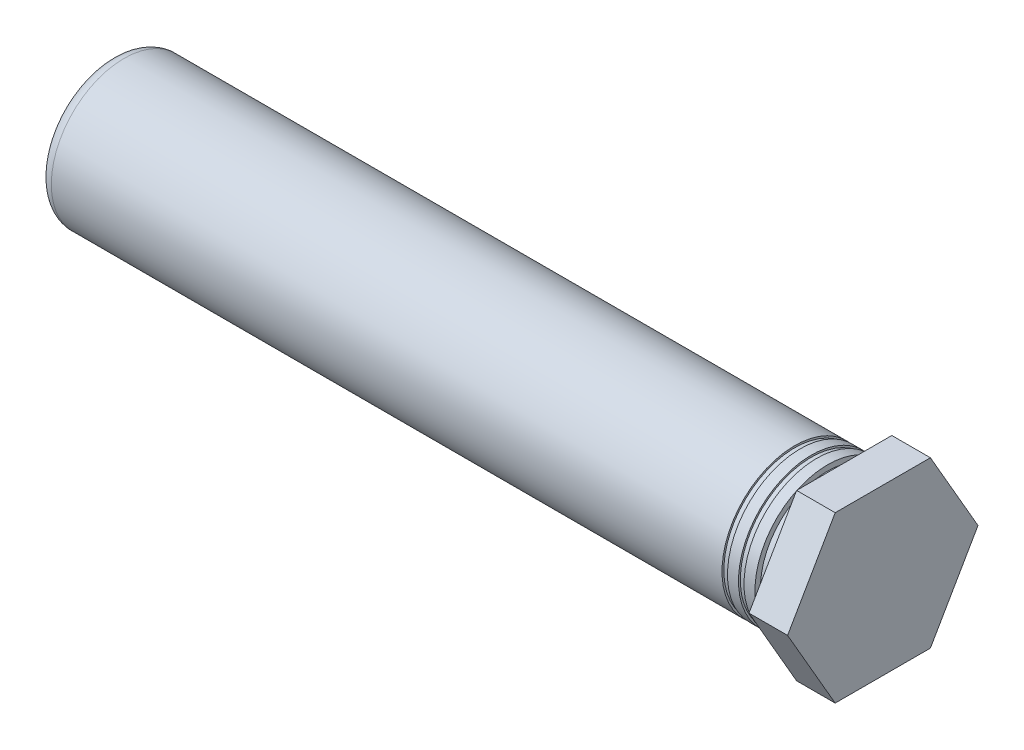
ISO-10303-21;
HEADER;
FILE_DESCRIPTION(('STEP AP214'),'2;1');
FILE_NAME('part.step','',(''),(''),'','','');
FILE_SCHEMA(('AUTOMOTIVE_DESIGN { 1 0 10303 214 1 1 1 1 }'));
ENDSEC;
DATA;
#1=APPLICATION_CONTEXT('core data for automotive mechanical design processes');
#2=APPLICATION_PROTOCOL_DEFINITION('international standard','automotive_design',2000,#1);
#3=PRODUCT_CONTEXT('',#1,'mechanical');
#4=PRODUCT('Part','Part','',(#3));
#5=PRODUCT_RELATED_PRODUCT_CATEGORY('part','',(#4));
#6=PRODUCT_DEFINITION_FORMATION('','',#4);
#7=PRODUCT_DEFINITION_CONTEXT('part definition',#1,'design');
#8=PRODUCT_DEFINITION('design','',#6,#7);
#9=PRODUCT_DEFINITION_SHAPE('','',#8);
#10=(LENGTH_UNIT() NAMED_UNIT(*) SI_UNIT(.MILLI.,.METRE.));
#11=(NAMED_UNIT(*) PLANE_ANGLE_UNIT() SI_UNIT($,.RADIAN.));
#12=(NAMED_UNIT(*) SI_UNIT($,.STERADIAN.) SOLID_ANGLE_UNIT());
#13=UNCERTAINTY_MEASURE_WITH_UNIT(LENGTH_MEASURE(1.E-05),#10,'distance_accuracy_value','');
#14=(GEOMETRIC_REPRESENTATION_CONTEXT(3) GLOBAL_UNCERTAINTY_ASSIGNED_CONTEXT((#13)) GLOBAL_UNIT_ASSIGNED_CONTEXT((#10,
#11,#12)) REPRESENTATION_CONTEXT('',''));
#15=CARTESIAN_POINT('',(0.,0.,0.));
#16=DIRECTION('',(0.,0.,1.));
#17=DIRECTION('',(1.,0.,0.));
#18=AXIS2_PLACEMENT_3D('',#15,#16,#17);
#19=CARTESIAN_POINT('',(1.11125,-2.3749,-2.7422983085969));
#20=DIRECTION('',(1.,0.,0.));
#21=DIRECTION('',(0.,1.,0.));
#22=AXIS2_PLACEMENT_3D('',#19,#20,#21);
#23=PLANE('',#22);
#24=DIRECTION('',(0.,0.,1.));
#25=VECTOR('',#24,1.);
#26=CARTESIAN_POINT('',(1.11125,-2.3749,0.));
#27=LINE('',#26,#25);
#28=CARTESIAN_POINT('',(1.11125,-2.3749,-1.3711491542984));
#29=VERTEX_POINT('',#28);
#30=CARTESIAN_POINT('',(1.11125,-2.3749,1.3711491542984));
#31=VERTEX_POINT('',#30);
#32=EDGE_CURVE('E77',#29,#31,#27,.T.);
#33=ORIENTED_EDGE('',*,*,#32,.F.);
#34=DIRECTION('',(0.,-0.86602540378443,0.500000000000015));
#35=VECTOR('',#34,1.);
#36=CARTESIAN_POINT('',(1.11125,-1.18745,-2.05672373144765));
#37=LINE('',#36,#35);
#38=CARTESIAN_POINT('',(1.11125,2.50003124105391E-10,-2.74229830845256));
#39=VERTEX_POINT('',#38);
#40=EDGE_CURVE('E73',#39,#29,#37,.T.);
#41=ORIENTED_EDGE('',*,*,#40,.F.);
#42=DIRECTION('',(0.,-0.866025403784429,-0.500000000000016));
#43=VECTOR('',#42,1.);
#44=CARTESIAN_POINT('',(1.11125,1.18745,-2.05672373144765));
#45=LINE('',#44,#43);
#46=CARTESIAN_POINT('',(1.11125,2.3749,-1.3711491542984));
#47=VERTEX_POINT('',#46);
#48=EDGE_CURVE('E75',#47,#39,#45,.T.);
#49=ORIENTED_EDGE('',*,*,#48,.F.);
#50=DIRECTION('',(0.,0.,-1.));
#51=VECTOR('',#50,1.);
#52=CARTESIAN_POINT('',(1.11125,2.3749,0.));
#53=LINE('',#52,#51);
#54=CARTESIAN_POINT('',(1.11125,2.3749,1.3711491542984));
#55=VERTEX_POINT('',#54);
#56=EDGE_CURVE('E59',#55,#47,#53,.T.);
#57=ORIENTED_EDGE('',*,*,#56,.F.);
#58=DIRECTION('',(0.,0.866025403784429,-0.500000000000016));
#59=VECTOR('',#58,1.);
#60=CARTESIAN_POINT('',(1.11125,1.18745,2.05672373144765));
#61=LINE('',#60,#59);
#62=CARTESIAN_POINT('',(1.11125,2.49999673740398E-10,2.74229830845256));
#63=VERTEX_POINT('',#62);
#64=EDGE_CURVE('E119',#63,#55,#61,.T.);
#65=ORIENTED_EDGE('',*,*,#64,.F.);
#66=DIRECTION('',(0.,0.866025403784429,0.500000000000016));
#67=VECTOR('',#66,1.);
#68=CARTESIAN_POINT('',(1.11125,-1.18745,2.05672373144765));
#69=LINE('',#68,#67);
#70=EDGE_CURVE('E106',#31,#63,#69,.T.);
#71=ORIENTED_EDGE('',*,*,#70,.F.);
#72=EDGE_LOOP('',(#33,#41,#49,#57,#65,#71));
#73=FACE_BOUND('',#72,.T.);
#74=ADVANCED_FACE('F16',(#73),#23,.T.);
#75=CARTESIAN_POINT('',(1.11125,0.,-2.7422983085969));
#76=DIRECTION('',(0.,0.500000000000016,-0.866025403784429));
#77=DIRECTION('',(-1.,0.,0.));
#78=AXIS2_PLACEMENT_3D('',#75,#76,#77);
#79=PLANE('',#78);
#80=CARTESIAN_POINT('',(1.11125,0.,-2.7422983085969));
#81=CARTESIAN_POINT('',(0.,0.,-2.7422983085969));
#82=B_SPLINE_CURVE_WITH_KNOTS('',1,(#80,#81),.UNSPECIFIED.,.F.,.F.,(2,2),(0.,1.11125),.UNSPECIFIED.);
#83=CARTESIAN_POINT('',(0.,0.,-2.7422983085969));
#84=VERTEX_POINT('',#83);
#85=EDGE_CURVE('E81',#84,#39,#82,.F.);
#86=ORIENTED_EDGE('',*,*,#85,.F.);
#87=DIRECTION('',(0.,-0.866025403784429,-0.500000000000016));
#88=VECTOR('',#87,1.);
#89=CARTESIAN_POINT('',(0.,2.3749,-1.3711491542984));
#90=LINE('',#89,#88);
#91=CARTESIAN_POINT('',(0.,2.3749,-1.3711491542984));
#92=VERTEX_POINT('',#91);
#93=EDGE_CURVE('E20',#92,#84,#90,.T.);
#94=ORIENTED_EDGE('',*,*,#93,.F.);
#95=CARTESIAN_POINT('',(1.11125,2.3749,-1.3711491542984));
#96=CARTESIAN_POINT('',(0.,2.3749,-1.3711491542984));
#97=B_SPLINE_CURVE_WITH_KNOTS('',1,(#95,#96),.UNSPECIFIED.,.F.,.F.,(2,2),(0.,1.11125),.UNSPECIFIED.);
#98=EDGE_CURVE('E85',#47,#92,#97,.T.);
#99=ORIENTED_EDGE('',*,*,#98,.F.);
#100=ORIENTED_EDGE('',*,*,#48,.T.);
#101=EDGE_LOOP('',(#86,#94,#99,#100));
#102=FACE_BOUND('',#101,.T.);
#103=ADVANCED_FACE('F83',(#102),#79,.T.);
#104=CARTESIAN_POINT('',(1.11125,-2.3749,-1.3711491542984));
#105=DIRECTION('',(0.,-0.500000000000015,-0.86602540378443));
#106=DIRECTION('',(-1.,0.,0.));
#107=AXIS2_PLACEMENT_3D('',#104,#105,#106);
#108=PLANE('',#107);
#109=CARTESIAN_POINT('',(1.11125,-2.3749,-1.3711491542984));
#110=CARTESIAN_POINT('',(0.,-2.3749,-1.3711491542984));
#111=B_SPLINE_CURVE_WITH_KNOTS('',1,(#109,#110),.UNSPECIFIED.,.F.,.F.,(2,2),(0.,1.11125),.UNSPECIFIED.);
#112=CARTESIAN_POINT('',(0.,-2.3749,-1.3711491542984));
#113=VERTEX_POINT('',#112);
#114=EDGE_CURVE('E91',#113,#29,#111,.F.);
#115=ORIENTED_EDGE('',*,*,#114,.F.);
#116=DIRECTION('',(0.,-0.86602540378443,0.500000000000015));
#117=VECTOR('',#116,1.);
#118=CARTESIAN_POINT('',(0.,0.,-2.7422983085969));
#119=LINE('',#118,#117);
#120=EDGE_CURVE('E89',#84,#113,#119,.T.);
#121=ORIENTED_EDGE('',*,*,#120,.F.);
#122=ORIENTED_EDGE('',*,*,#85,.T.);
#123=ORIENTED_EDGE('',*,*,#40,.T.);
#124=EDGE_LOOP('',(#115,#121,#122,#123));
#125=FACE_BOUND('',#124,.T.);
#126=ADVANCED_FACE('F87',(#125),#108,.T.);
#127=CARTESIAN_POINT('',(1.11125,-2.3749,1.3711491542984));
#128=DIRECTION('',(0.,-1.,0.));
#129=DIRECTION('',(-1.,0.,0.));
#130=AXIS2_PLACEMENT_3D('',#127,#128,#129);
#131=PLANE('',#130);
#132=CARTESIAN_POINT('',(1.11125,-2.3749,1.3711491542984));
#133=CARTESIAN_POINT('',(0.,-2.3749,1.3711491542984));
#134=B_SPLINE_CURVE_WITH_KNOTS('',1,(#132,#133),.UNSPECIFIED.,.F.,.F.,(2,2),(0.,1.11125),.UNSPECIFIED.);
#135=CARTESIAN_POINT('',(0.,-2.3749,1.3711491542984));
#136=VERTEX_POINT('',#135);
#137=EDGE_CURVE('E114',#136,#31,#134,.F.);
#138=ORIENTED_EDGE('',*,*,#137,.F.);
#139=DIRECTION('',(0.,0.,1.));
#140=VECTOR('',#139,1.);
#141=CARTESIAN_POINT('',(0.,-2.3749,0.));
#142=LINE('',#141,#140);
#143=EDGE_CURVE('E107',#113,#136,#142,.T.);
#144=ORIENTED_EDGE('',*,*,#143,.F.);
#145=ORIENTED_EDGE('',*,*,#114,.T.);
#146=ORIENTED_EDGE('',*,*,#32,.T.);
#147=EDGE_LOOP('',(#138,#144,#145,#146));
#148=FACE_BOUND('',#147,.T.);
#149=ADVANCED_FACE('F384',(#148),#131,.T.);
#150=CARTESIAN_POINT('',(1.11125,0.,2.7422983085969));
#151=DIRECTION('',(0.,-0.500000000000016,0.866025403784429));
#152=DIRECTION('',(-1.,0.,0.));
#153=AXIS2_PLACEMENT_3D('',#150,#151,#152);
#154=PLANE('',#153);
#155=CARTESIAN_POINT('',(1.11125,0.,2.7422983085969));
#156=CARTESIAN_POINT('',(0.,0.,2.7422983085969));
#157=B_SPLINE_CURVE_WITH_KNOTS('',1,(#155,#156),.UNSPECIFIED.,.F.,.F.,(2,2),(0.,1.11125),.UNSPECIFIED.);
#158=CARTESIAN_POINT('',(0.,0.,2.7422983085969));
#159=VERTEX_POINT('',#158);
#160=EDGE_CURVE('E125',#159,#63,#157,.F.);
#161=ORIENTED_EDGE('',*,*,#160,.F.);
#162=DIRECTION('',(0.,0.866025403784429,0.500000000000016));
#163=VECTOR('',#162,1.);
#164=CARTESIAN_POINT('',(0.,-2.3749,1.3711491542984));
#165=LINE('',#164,#163);
#166=EDGE_CURVE('E113',#136,#159,#165,.T.);
#167=ORIENTED_EDGE('',*,*,#166,.F.);
#168=ORIENTED_EDGE('',*,*,#137,.T.);
#169=ORIENTED_EDGE('',*,*,#70,.T.);
#170=EDGE_LOOP('',(#161,#167,#168,#169));
#171=FACE_BOUND('',#170,.T.);
#172=ADVANCED_FACE('F207',(#171),#154,.T.);
#173=CARTESIAN_POINT('',(1.11125,2.3749,1.3711491542984));
#174=DIRECTION('',(0.,0.500000000000016,0.866025403784429));
#175=DIRECTION('',(-1.,0.,0.));
#176=AXIS2_PLACEMENT_3D('',#173,#174,#175);
#177=PLANE('',#176);
#178=CARTESIAN_POINT('',(1.11125,2.3749,1.3711491542984));
#179=CARTESIAN_POINT('',(0.,2.3749,1.3711491542984));
#180=B_SPLINE_CURVE_WITH_KNOTS('',1,(#178,#179),.UNSPECIFIED.,.F.,.F.,(2,2),(0.,1.11125),.UNSPECIFIED.);
#181=CARTESIAN_POINT('',(0.,2.3749,1.3711491542984));
#182=VERTEX_POINT('',#181);
#183=EDGE_CURVE('E124',#182,#55,#180,.F.);
#184=ORIENTED_EDGE('',*,*,#183,.F.);
#185=DIRECTION('',(0.,0.866025403784429,-0.500000000000016));
#186=VECTOR('',#185,1.);
#187=CARTESIAN_POINT('',(0.,0.,2.7422983085969));
#188=LINE('',#187,#186);
#189=EDGE_CURVE('E174',#159,#182,#188,.T.);
#190=ORIENTED_EDGE('',*,*,#189,.F.);
#191=ORIENTED_EDGE('',*,*,#160,.T.);
#192=ORIENTED_EDGE('',*,*,#64,.T.);
#193=EDGE_LOOP('',(#184,#190,#191,#192));
#194=FACE_BOUND('',#193,.T.);
#195=ADVANCED_FACE('F198',(#194),#177,.T.);
#196=CARTESIAN_POINT('',(1.11125,2.3749,-1.3711491542984));
#197=DIRECTION('',(0.,1.,0.));
#198=DIRECTION('',(-1.,0.,0.));
#199=AXIS2_PLACEMENT_3D('',#196,#197,#198);
#200=PLANE('',#199);
#201=ORIENTED_EDGE('',*,*,#98,.T.);
#202=DIRECTION('',(0.,0.,-1.));
#203=VECTOR('',#202,1.);
#204=CARTESIAN_POINT('',(0.,2.3749,0.));
#205=LINE('',#204,#203);
#206=EDGE_CURVE('E173',#182,#92,#205,.T.);
#207=ORIENTED_EDGE('',*,*,#206,.F.);
#208=ORIENTED_EDGE('',*,*,#183,.T.);
#209=ORIENTED_EDGE('',*,*,#56,.T.);
#210=EDGE_LOOP('',(#201,#207,#208,#209));
#211=FACE_BOUND('',#210,.T.);
#212=ADVANCED_FACE('F196',(#211),#200,.T.);
#213=CARTESIAN_POINT('',(0.,2.3749,-2.7422983085969));
#214=DIRECTION('',(-1.,0.,0.));
#215=DIRECTION('',(0.,-1.,0.));
#216=AXIS2_PLACEMENT_3D('',#213,#214,#215);
#217=PLANE('',#216);
#218=ORIENTED_EDGE('',*,*,#189,.T.);
#219=ORIENTED_EDGE('',*,*,#206,.T.);
#220=ORIENTED_EDGE('',*,*,#93,.T.);
#221=ORIENTED_EDGE('',*,*,#120,.T.);
#222=ORIENTED_EDGE('',*,*,#143,.T.);
#223=ORIENTED_EDGE('',*,*,#166,.T.);
#224=EDGE_LOOP('',(#218,#219,#220,#221,#222,#223));
#225=FACE_BOUND('',#224,.T.);
#226=CARTESIAN_POINT('',(0.,0.,0.));
#227=DIRECTION('',(1.,0.,0.));
#228=DIRECTION('',(0.,0.,-1.));
#229=AXIS2_PLACEMENT_3D('',#226,#227,#228);
#230=CIRCLE('',#229,1.9371733333333);
#231=CARTESIAN_POINT('',(0.,0.,-1.9371733333333));
#232=VERTEX_POINT('',#231);
#233=EDGE_CURVE('E170',#232,#232,#230,.F.);
#234=ORIENTED_EDGE('',*,*,#233,.F.);
#235=EDGE_LOOP('',(#234));
#236=FACE_BOUND('',#235,.T.);
#237=ADVANCED_FACE('F193',(#225,#236),#217,.T.);
#238=CARTESIAN_POINT('',(-0.47498,0.,0.));
#239=DIRECTION('',(1.,0.,0.));
#240=DIRECTION('',(0.,0.,-1.));
#241=AXIS2_PLACEMENT_3D('',#238,#239,#240);
#242=CYLINDRICAL_SURFACE('',#241,1.9371733333333);
#243=CARTESIAN_POINT('',(-0.47498,0.,0.));
#244=DIRECTION('',(1.,0.,0.));
#245=DIRECTION('',(0.,0.,-1.));
#246=AXIS2_PLACEMENT_3D('',#243,#244,#245);
#247=CIRCLE('',#246,1.9371733333333);
#248=CARTESIAN_POINT('',(-0.47498,0.,-1.9371733333333));
#249=VERTEX_POINT('',#248);
#250=EDGE_CURVE('E167',#249,#249,#247,.F.);
#251=ORIENTED_EDGE('',*,*,#250,.F.);
#252=EDGE_LOOP('',(#251));
#253=FACE_BOUND('',#252,.T.);
#254=ORIENTED_EDGE('',*,*,#233,.T.);
#255=EDGE_LOOP('',(#254));
#256=FACE_BOUND('',#255,.T.);
#257=ADVANCED_FACE('F205',(#253,#256),#242,.T.);
#258=CARTESIAN_POINT('',(-0.47498,-2.0955,2.13741));
#259=DIRECTION('',(1.,0.,0.));
#260=DIRECTION('',(0.,0.,-1.));
#261=AXIS2_PLACEMENT_3D('',#258,#259,#260);
#262=PLANE('',#261);
#263=CARTESIAN_POINT('',(-0.47498,0.,0.));
#264=DIRECTION('',(1.,0.,0.));
#265=DIRECTION('',(0.,0.,-1.));
#266=AXIS2_PLACEMENT_3D('',#263,#264,#265);
#267=CIRCLE('',#266,2.0955);
#268=CARTESIAN_POINT('',(-0.47498,0.,-2.0955));
#269=VERTEX_POINT('',#268);
#270=EDGE_CURVE('E164',#269,#269,#267,.F.);
#271=ORIENTED_EDGE('',*,*,#270,.F.);
#272=EDGE_LOOP('',(#271));
#273=FACE_BOUND('',#272,.T.);
#274=ORIENTED_EDGE('',*,*,#250,.T.);
#275=EDGE_LOOP('',(#274));
#276=FACE_BOUND('',#275,.T.);
#277=ADVANCED_FACE('F352',(#273,#276),#262,.T.);
#278=CARTESIAN_POINT('',(-0.79163333333333,0.,0.));
#279=DIRECTION('',(1.,0.,0.));
#280=DIRECTION('',(0.,0.,-1.));
#281=AXIS2_PLACEMENT_3D('',#278,#279,#280);
#282=CYLINDRICAL_SURFACE('',#281,2.0955);
#283=ORIENTED_EDGE('',*,*,#270,.T.);
#284=EDGE_LOOP('',(#283));
#285=FACE_BOUND('',#284,.T.);
#286=CARTESIAN_POINT('',(-0.79163333333333,0.,0.));
#287=DIRECTION('',(1.,0.,0.));
#288=DIRECTION('',(0.,0.,-1.));
#289=AXIS2_PLACEMENT_3D('',#286,#287,#288);
#290=CIRCLE('',#289,2.0955);
#291=CARTESIAN_POINT('',(-0.79163333333333,0.,-2.0955));
#292=VERTEX_POINT('',#291);
#293=EDGE_CURVE('E161',#292,#292,#290,.F.);
#294=ORIENTED_EDGE('',*,*,#293,.F.);
#295=EDGE_LOOP('',(#294));
#296=FACE_BOUND('',#295,.T.);
#297=ADVANCED_FACE('F344',(#285,#296),#282,.T.);
#298=CARTESIAN_POINT('',(-0.79163333333333,-2.0955,-2.0955));
#299=DIRECTION('',(-1.,0.,0.));
#300=DIRECTION('',(0.,0.,1.));
#301=AXIS2_PLACEMENT_3D('',#298,#299,#300);
#302=PLANE('',#301);
#303=CARTESIAN_POINT('',(-0.79163333333333,0.,0.));
#304=DIRECTION('',(1.,0.,0.));
#305=DIRECTION('',(0.,0.,-1.));
#306=AXIS2_PLACEMENT_3D('',#303,#304,#305);
#307=CIRCLE('',#306,2.0427244444444);
#308=CARTESIAN_POINT('',(-0.79163333333333,0.,-2.0427244444444));
#309=VERTEX_POINT('',#308);
#310=EDGE_CURVE('E158',#309,#309,#307,.F.);
#311=ORIENTED_EDGE('',*,*,#310,.F.);
#312=EDGE_LOOP('',(#311));
#313=FACE_BOUND('',#312,.T.);
#314=ORIENTED_EDGE('',*,*,#293,.T.);
#315=EDGE_LOOP('',(#314));
#316=FACE_BOUND('',#315,.T.);
#317=ADVANCED_FACE('F336',(#313,#316),#302,.T.);
#318=CARTESIAN_POINT('',(-0.94996,0.,0.));
#319=DIRECTION('',(1.,0.,0.));
#320=DIRECTION('',(0.,0.,-1.));
#321=AXIS2_PLACEMENT_3D('',#318,#319,#320);
#322=CYLINDRICAL_SURFACE('',#321,2.0427244444444);
#323=CARTESIAN_POINT('',(-0.94996,0.,0.));
#324=DIRECTION('',(1.,0.,0.));
#325=DIRECTION('',(0.,0.,-1.));
#326=AXIS2_PLACEMENT_3D('',#323,#324,#325);
#327=CIRCLE('',#326,2.0427244444444);
#328=CARTESIAN_POINT('',(-0.94996,0.,-2.0427244444444));
#329=VERTEX_POINT('',#328);
#330=EDGE_CURVE('E155',#329,#329,#327,.F.);
#331=ORIENTED_EDGE('',*,*,#330,.F.);
#332=EDGE_LOOP('',(#331));
#333=FACE_BOUND('',#332,.T.);
#334=ORIENTED_EDGE('',*,*,#310,.T.);
#335=EDGE_LOOP('',(#334));
#336=FACE_BOUND('',#335,.T.);
#337=ADVANCED_FACE('F328',(#333,#336),#322,.T.);
#338=CARTESIAN_POINT('',(-0.94996,-2.0955,2.13741));
#339=DIRECTION('',(1.,0.,0.));
#340=DIRECTION('',(0.,0.,-1.));
#341=AXIS2_PLACEMENT_3D('',#338,#339,#340);
#342=PLANE('',#341);
#343=CARTESIAN_POINT('',(-0.94996,0.,0.));
#344=DIRECTION('',(1.,0.,0.));
#345=DIRECTION('',(0.,0.,-1.));
#346=AXIS2_PLACEMENT_3D('',#343,#344,#345);
#347=CIRCLE('',#346,2.0955);
#348=CARTESIAN_POINT('',(-0.94996,0.,-2.0955));
#349=VERTEX_POINT('',#348);
#350=EDGE_CURVE('E152',#349,#349,#347,.F.);
#351=ORIENTED_EDGE('',*,*,#350,.F.);
#352=EDGE_LOOP('',(#351));
#353=FACE_BOUND('',#352,.T.);
#354=ORIENTED_EDGE('',*,*,#330,.T.);
#355=EDGE_LOOP('',(#354));
#356=FACE_BOUND('',#355,.T.);
#357=ADVANCED_FACE('F320',(#353,#356),#342,.T.);
#358=CARTESIAN_POINT('',(-1.2666133333333,0.,0.));
#359=DIRECTION('',(1.,0.,0.));
#360=DIRECTION('',(0.,0.,-1.));
#361=AXIS2_PLACEMENT_3D('',#358,#359,#360);
#362=CYLINDRICAL_SURFACE('',#361,2.0955);
#363=ORIENTED_EDGE('',*,*,#350,.T.);
#364=EDGE_LOOP('',(#363));
#365=FACE_BOUND('',#364,.T.);
#366=CARTESIAN_POINT('',(-1.2666133333333,0.,0.));
#367=DIRECTION('',(1.,0.,0.));
#368=DIRECTION('',(0.,0.,-1.));
#369=AXIS2_PLACEMENT_3D('',#366,#367,#368);
#370=CIRCLE('',#369,2.0955);
#371=CARTESIAN_POINT('',(-1.2666133333333,0.,-2.0955));
#372=VERTEX_POINT('',#371);
#373=EDGE_CURVE('E149',#372,#372,#370,.F.);
#374=ORIENTED_EDGE('',*,*,#373,.F.);
#375=EDGE_LOOP('',(#374));
#376=FACE_BOUND('',#375,.T.);
#377=ADVANCED_FACE('F313',(#365,#376),#362,.T.);
#378=CARTESIAN_POINT('',(-1.2666133333333,-2.0955,-2.0955));
#379=DIRECTION('',(-1.,0.,0.));
#380=DIRECTION('',(0.,0.,1.));
#381=AXIS2_PLACEMENT_3D('',#378,#379,#380);
#382=PLANE('',#381);
#383=CARTESIAN_POINT('',(-1.2666133333333,0.,0.));
#384=DIRECTION('',(1.,0.,0.));
#385=DIRECTION('',(0.,0.,-1.));
#386=AXIS2_PLACEMENT_3D('',#383,#384,#385);
#387=CIRCLE('',#386,2.0427244444444);
#388=CARTESIAN_POINT('',(-1.2666133333333,0.,-2.0427244444444));
#389=VERTEX_POINT('',#388);
#390=EDGE_CURVE('E146',#389,#389,#387,.F.);
#391=ORIENTED_EDGE('',*,*,#390,.F.);
#392=EDGE_LOOP('',(#391));
#393=FACE_BOUND('',#392,.T.);
#394=ORIENTED_EDGE('',*,*,#373,.T.);
#395=EDGE_LOOP('',(#394));
#396=FACE_BOUND('',#395,.T.);
#397=ADVANCED_FACE('F242',(#393,#396),#382,.T.);
#398=CARTESIAN_POINT('',(-1.42494,0.,0.));
#399=DIRECTION('',(1.,0.,0.));
#400=DIRECTION('',(0.,0.,-1.));
#401=AXIS2_PLACEMENT_3D('',#398,#399,#400);
#402=CYLINDRICAL_SURFACE('',#401,2.0427244444444);
#403=CARTESIAN_POINT('',(-1.42494,0.,0.));
#404=DIRECTION('',(1.,0.,0.));
#405=DIRECTION('',(0.,0.,-1.));
#406=AXIS2_PLACEMENT_3D('',#403,#404,#405);
#407=CIRCLE('',#406,2.0427244444444);
#408=CARTESIAN_POINT('',(-1.42494,0.,-2.0427244444444));
#409=VERTEX_POINT('',#408);
#410=EDGE_CURVE('E143',#409,#409,#407,.F.);
#411=ORIENTED_EDGE('',*,*,#410,.F.);
#412=EDGE_LOOP('',(#411));
#413=FACE_BOUND('',#412,.T.);
#414=ORIENTED_EDGE('',*,*,#390,.T.);
#415=EDGE_LOOP('',(#414));
#416=FACE_BOUND('',#415,.T.);
#417=ADVANCED_FACE('F234',(#413,#416),#402,.T.);
#418=CARTESIAN_POINT('',(-2.6225122033853,0.,0.));
#419=DIRECTION('',(-1.,0.,0.));
#420=DIRECTION('',(0.,-1.,0.));
#421=AXIS2_PLACEMENT_3D('',#418,#419,#420);
#422=CONICAL_SURFACE('',#421,0.,1.0471975511966);
#423=CARTESIAN_POINT('',(-2.6225122033853,0.,0.));
#424=VERTEX_POINT('',#423);
#425=VERTEX_LOOP('',#424);
#426=FACE_BOUND('',#425,.T.);
#427=CARTESIAN_POINT('',(-3.33375,0.,0.));
#428=DIRECTION('',(1.,0.,0.));
#429=DIRECTION('',(0.,1.,0.));
#430=AXIS2_PLACEMENT_3D('',#427,#428,#429);
#431=CIRCLE('',#430,1.2319);
#432=CARTESIAN_POINT('',(-3.33375,1.2319,0.));
#433=VERTEX_POINT('',#432);
#434=EDGE_CURVE('E142',#433,#433,#431,.T.);
#435=ORIENTED_EDGE('',*,*,#434,.F.);
#436=EDGE_LOOP('',(#435));
#437=FACE_BOUND('',#436,.T.);
#438=ADVANCED_FACE('F231',(#426,#437),#422,.F.);
#439=CARTESIAN_POINT('',(-1.42494,-2.0955,2.13741));
#440=DIRECTION('',(1.,0.,0.));
#441=DIRECTION('',(0.,0.,-1.));
#442=AXIS2_PLACEMENT_3D('',#439,#440,#441);
#443=PLANE('',#442);
#444=CARTESIAN_POINT('',(-1.42494,0.,0.));
#445=DIRECTION('',(1.,0.,0.));
#446=DIRECTION('',(0.,0.,-1.));
#447=AXIS2_PLACEMENT_3D('',#444,#445,#446);
#448=CIRCLE('',#447,2.0955);
#449=CARTESIAN_POINT('',(-1.42494,0.,-2.0955));
#450=VERTEX_POINT('',#449);
#451=EDGE_CURVE('E139',#450,#450,#448,.F.);
#452=ORIENTED_EDGE('',*,*,#451,.F.);
#453=EDGE_LOOP('',(#452));
#454=FACE_BOUND('',#453,.T.);
#455=ORIENTED_EDGE('',*,*,#410,.T.);
#456=EDGE_LOOP('',(#455));
#457=FACE_BOUND('',#456,.T.);
#458=ADVANCED_FACE('F233',(#454,#457),#443,.T.);
#459=CARTESIAN_POINT('',(-3.33375,0.,0.));
#460=DIRECTION('',(-1.,0.,0.));
#461=DIRECTION('',(0.,-1.,0.));
#462=AXIS2_PLACEMENT_3D('',#459,#460,#461);
#463=CYLINDRICAL_SURFACE('',#462,1.2319);
#464=CARTESIAN_POINT('',(-11.58875,0.,0.));
#465=DIRECTION('',(-1.,0.,0.));
#466=DIRECTION('',(0.,-1.,0.));
#467=AXIS2_PLACEMENT_3D('',#464,#465,#466);
#468=CIRCLE('',#467,1.2319);
#469=CARTESIAN_POINT('',(-11.58875,-1.23189999999999,0.));
#470=VERTEX_POINT('',#469);
#471=EDGE_CURVE('E136',#470,#470,#468,.F.);
#472=ORIENTED_EDGE('',*,*,#471,.F.);
#473=EDGE_LOOP('',(#472));
#474=FACE_BOUND('',#473,.T.);
#475=ORIENTED_EDGE('',*,*,#434,.T.);
#476=EDGE_LOOP('',(#475));
#477=FACE_BOUND('',#476,.T.);
#478=ADVANCED_FACE('F229',(#474,#477),#463,.F.);
#479=CARTESIAN_POINT('',(-20.743333333333,0.,0.));
#480=DIRECTION('',(1.,0.,0.));
#481=DIRECTION('',(0.,0.,-1.));
#482=AXIS2_PLACEMENT_3D('',#479,#480,#481);
#483=CYLINDRICAL_SURFACE('',#482,2.0955);
#484=CARTESIAN_POINT('',(-20.743333333333,0.,0.));
#485=DIRECTION('',(-1.,0.,0.));
#486=DIRECTION('',(0.,0.,1.));
#487=AXIS2_PLACEMENT_3D('',#484,#485,#486);
#488=CIRCLE('',#487,2.0955);
#489=CARTESIAN_POINT('',(-20.743333333333,0.,2.0955));
#490=VERTEX_POINT('',#489);
#491=EDGE_CURVE('E135',#490,#490,#488,.T.);
#492=ORIENTED_EDGE('',*,*,#491,.F.);
#493=EDGE_LOOP('',(#492));
#494=FACE_BOUND('',#493,.T.);
#495=ORIENTED_EDGE('',*,*,#451,.T.);
#496=EDGE_LOOP('',(#495));
#497=FACE_BOUND('',#496,.T.);
#498=ADVANCED_FACE('F249',(#494,#497),#483,.T.);
#499=CARTESIAN_POINT('',(-11.58875,1.256538,-1.2319));
#500=DIRECTION('',(1.,0.,0.));
#501=DIRECTION('',(0.,0.,1.));
#502=AXIS2_PLACEMENT_3D('',#499,#500,#501);
#503=PLANE('',#502);
#504=CARTESIAN_POINT('',(-11.58875,0.,0.));
#505=DIRECTION('',(-1.,0.,0.));
#506=DIRECTION('',(0.,0.,1.));
#507=AXIS2_PLACEMENT_3D('',#504,#505,#506);
#508=CIRCLE('',#507,1.1049);
#509=CARTESIAN_POINT('',(-11.58875,0.,1.1049));
#510=VERTEX_POINT('',#509);
#511=EDGE_CURVE('E132',#510,#510,#508,.F.);
#512=ORIENTED_EDGE('',*,*,#511,.F.);
#513=EDGE_LOOP('',(#512));
#514=FACE_BOUND('',#513,.T.);
#515=ORIENTED_EDGE('',*,*,#471,.T.);
#516=EDGE_LOOP('',(#515));
#517=FACE_BOUND('',#516,.T.);
#518=ADVANCED_FACE('F253',(#514,#517),#503,.T.);
#519=CARTESIAN_POINT('',(-20.743333333333,0.,0.));
#520=DIRECTION('',(1.,0.,0.));
#521=DIRECTION('',(0.,0.,-1.));
#522=AXIS2_PLACEMENT_3D('',#519,#520,#521);
#523=TOROIDAL_SURFACE('',#522,1.7250833333333,0.370416666666856);
#524=CARTESIAN_POINT('',(-21.1137499999998,0.,0.));
#525=DIRECTION('',(1.,0.,0.));
#526=DIRECTION('',(0.,0.,-1.));
#527=AXIS2_PLACEMENT_3D('',#524,#525,#526);
#528=CIRCLE('',#527,1.7250833333333);
#529=CARTESIAN_POINT('',(-21.1137499999998,0.,-1.7250833333333));
#530=VERTEX_POINT('',#529);
#531=EDGE_CURVE('E129',#530,#530,#528,.F.);
#532=ORIENTED_EDGE('',*,*,#531,.F.);
#533=EDGE_LOOP('',(#532));
#534=FACE_BOUND('',#533,.T.);
#535=ORIENTED_EDGE('',*,*,#491,.T.);
#536=EDGE_LOOP('',(#535));
#537=FACE_BOUND('',#536,.T.);
#538=ADVANCED_FACE('F257',(#534,#537),#523,.T.);
#539=CARTESIAN_POINT('',(-11.58875,0.,0.));
#540=DIRECTION('',(-1.,0.,0.));
#541=DIRECTION('',(0.,0.,1.));
#542=AXIS2_PLACEMENT_3D('',#539,#540,#541);
#543=CYLINDRICAL_SURFACE('',#542,1.1049);
#544=ORIENTED_EDGE('',*,*,#511,.T.);
#545=EDGE_LOOP('',(#544));
#546=FACE_BOUND('',#545,.T.);
#547=CARTESIAN_POINT('',(-20.79625,0.,0.));
#548=DIRECTION('',(1.,0.,0.));
#549=DIRECTION('',(0.,0.,-1.));
#550=AXIS2_PLACEMENT_3D('',#547,#548,#549);
#551=CIRCLE('',#550,1.1049);
#552=CARTESIAN_POINT('',(-20.79625,0.,-1.1049));
#553=VERTEX_POINT('',#552);
#554=EDGE_CURVE('E26',#553,#553,#551,.T.);
#555=ORIENTED_EDGE('',*,*,#554,.F.);
#556=EDGE_LOOP('',(#555));
#557=FACE_BOUND('',#556,.T.);
#558=ADVANCED_FACE('F216',(#546,#557),#543,.F.);
#559=CARTESIAN_POINT('',(-21.11375,1.7250833333333,-1.75958499999997));
#560=DIRECTION('',(-1.,0.,0.));
#561=DIRECTION('',(0.,-1.,0.));
#562=AXIS2_PLACEMENT_3D('',#559,#560,#561);
#563=PLANE('',#562);
#564=ORIENTED_EDGE('',*,*,#531,.T.);
#565=EDGE_LOOP('',(#564));
#566=FACE_BOUND('',#565,.T.);
#567=CARTESIAN_POINT('',(-21.11375,0.,0.));
#568=DIRECTION('',(-1.,0.,0.));
#569=DIRECTION('',(0.,0.,1.));
#570=AXIS2_PLACEMENT_3D('',#567,#568,#569);
#571=CIRCLE('',#570,1.4224);
#572=CARTESIAN_POINT('',(-21.11375,0.,1.4224));
#573=VERTEX_POINT('',#572);
#574=EDGE_CURVE('E10',#573,#573,#571,.T.);
#575=ORIENTED_EDGE('',*,*,#574,.F.);
#576=EDGE_LOOP('',(#575));
#577=FACE_BOUND('',#576,.T.);
#578=ADVANCED_FACE('F211',(#566,#577),#563,.T.);
#579=CARTESIAN_POINT('',(-20.79625,0.,0.));
#580=DIRECTION('',(-1.,0.,0.));
#581=DIRECTION('',(0.,0.,1.));
#582=AXIS2_PLACEMENT_3D('',#579,#580,#581);
#583=CONICAL_SURFACE('',#582,1.1049,0.785398163397445);
#584=ORIENTED_EDGE('',*,*,#574,.T.);
#585=EDGE_LOOP('',(#584));
#586=FACE_BOUND('',#585,.T.);
#587=ORIENTED_EDGE('',*,*,#554,.T.);
#588=EDGE_LOOP('',(#587));
#589=FACE_BOUND('',#588,.T.);
#590=ADVANCED_FACE('F18',(#586,#589),#583,.F.);
#591=CLOSED_SHELL('',(#74,#103,#126,#149,#172,#195,#212,#237,#257,#277,#297,#317,#337,#357,#377,
#397,#417,#438,#458,#478,#498,#518,#538,#558,#578,#590));
#592=MANIFOLD_SOLID_BREP('B1',#591);
#593=ADVANCED_BREP_SHAPE_REPRESENTATION('',(#18,#592),#14);
#594=SHAPE_DEFINITION_REPRESENTATION(#9,#593);
ENDSEC;
END-ISO-10303-21;
